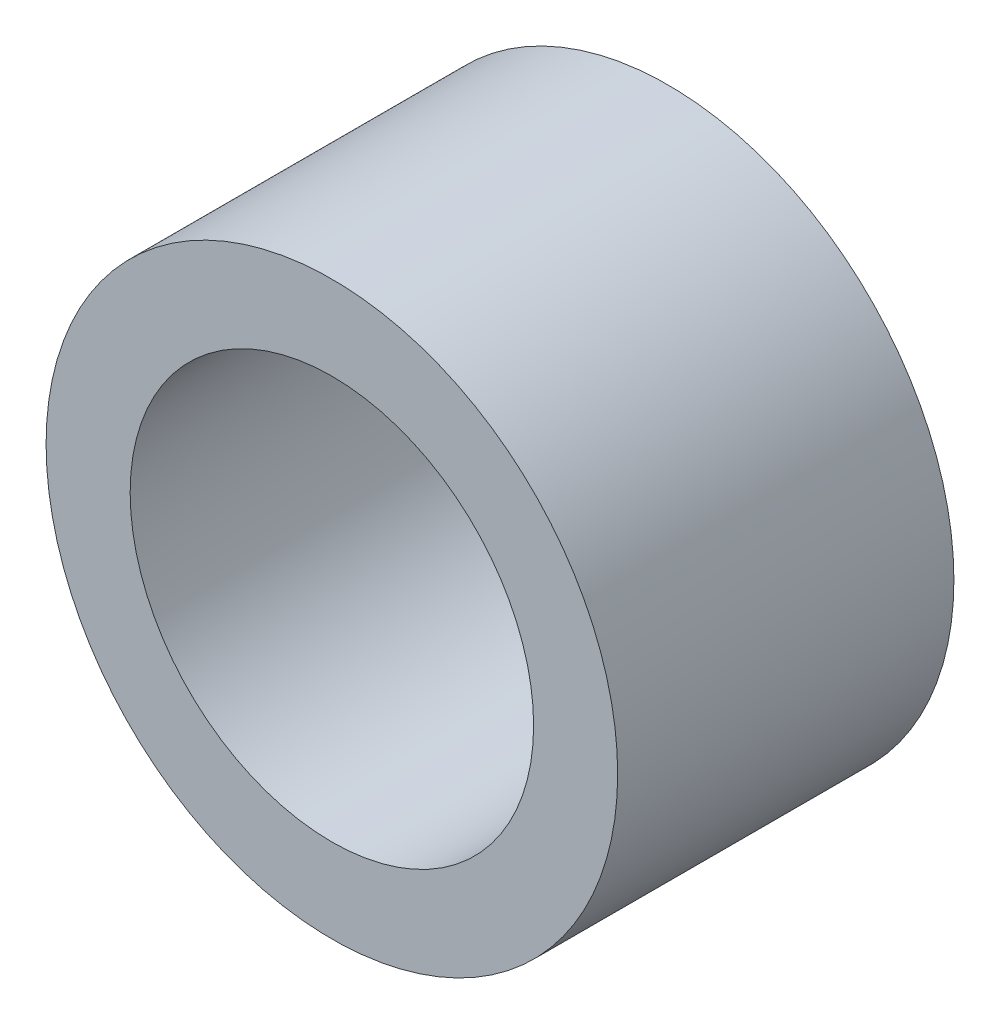
ISO-10303-21;
HEADER;
FILE_DESCRIPTION(('STEP AP214'),'2;1');
FILE_NAME('part.step','',(''),(''),'','','');
FILE_SCHEMA(('AUTOMOTIVE_DESIGN { 1 0 10303 214 1 1 1 1 }'));
ENDSEC;
DATA;
#1=APPLICATION_CONTEXT('core data for automotive mechanical design processes');
#2=APPLICATION_PROTOCOL_DEFINITION('international standard','automotive_design',2000,#1);
#3=PRODUCT_CONTEXT('',#1,'mechanical');
#4=PRODUCT('Part','Part','',(#3));
#5=PRODUCT_RELATED_PRODUCT_CATEGORY('part','',(#4));
#6=PRODUCT_DEFINITION_FORMATION('','',#4);
#7=PRODUCT_DEFINITION_CONTEXT('part definition',#1,'design');
#8=PRODUCT_DEFINITION('design','',#6,#7);
#9=PRODUCT_DEFINITION_SHAPE('','',#8);
#10=(LENGTH_UNIT() NAMED_UNIT(*) SI_UNIT(.MILLI.,.METRE.));
#11=(NAMED_UNIT(*) PLANE_ANGLE_UNIT() SI_UNIT($,.RADIAN.));
#12=(NAMED_UNIT(*) SI_UNIT($,.STERADIAN.) SOLID_ANGLE_UNIT());
#13=UNCERTAINTY_MEASURE_WITH_UNIT(LENGTH_MEASURE(1.E-05),#10,'distance_accuracy_value','');
#14=(GEOMETRIC_REPRESENTATION_CONTEXT(3) GLOBAL_UNCERTAINTY_ASSIGNED_CONTEXT((#13)) GLOBAL_UNIT_ASSIGNED_CONTEXT((#10,
#11,#12)) REPRESENTATION_CONTEXT('',''));
#15=CARTESIAN_POINT('',(0.,0.,0.));
#16=DIRECTION('',(0.,0.,1.));
#17=DIRECTION('',(1.,0.,0.));
#18=AXIS2_PLACEMENT_3D('',#15,#16,#17);
#19=CARTESIAN_POINT('',(0.,0.,10.));
#20=DIRECTION('',(0.,0.,1.));
#21=DIRECTION('',(1.,0.,0.));
#22=AXIS2_PLACEMENT_3D('',#19,#20,#21);
#23=PLANE('',#22);
#24=CARTESIAN_POINT('',(0.,0.,10.));
#25=DIRECTION('',(0.,0.,1.));
#26=DIRECTION('',(1.,0.,0.));
#27=AXIS2_PLACEMENT_3D('',#24,#25,#26);
#28=CIRCLE('',#27,17.);
#29=CARTESIAN_POINT('',(17.,0.,10.));
#30=VERTEX_POINT('',#29);
#31=EDGE_CURVE('E10',#30,#30,#28,.T.);
#32=ORIENTED_EDGE('',*,*,#31,.T.);
#33=EDGE_LOOP('',(#32));
#34=FACE_BOUND('',#33,.T.);
#35=CARTESIAN_POINT('',(0.,0.,10.));
#36=DIRECTION('',(0.,0.,1.));
#37=DIRECTION('',(1.,0.,0.));
#38=AXIS2_PLACEMENT_3D('',#35,#36,#37);
#39=CIRCLE('',#38,12.);
#40=CARTESIAN_POINT('',(12.,0.,10.));
#41=VERTEX_POINT('',#40);
#42=EDGE_CURVE('E48',#41,#41,#39,.T.);
#43=ORIENTED_EDGE('',*,*,#42,.F.);
#44=EDGE_LOOP('',(#43));
#45=FACE_BOUND('',#44,.T.);
#46=ADVANCED_FACE('F37',(#34,#45),#23,.T.);
#47=CARTESIAN_POINT('',(0.,0.,-10.));
#48=DIRECTION('',(0.,0.,1.));
#49=DIRECTION('',(1.,0.,0.));
#50=AXIS2_PLACEMENT_3D('',#47,#48,#49);
#51=PLANE('',#50);
#52=CARTESIAN_POINT('',(0.,0.,-10.));
#53=DIRECTION('',(0.,0.,1.));
#54=DIRECTION('',(1.,0.,0.));
#55=AXIS2_PLACEMENT_3D('',#52,#53,#54);
#56=CIRCLE('',#55,17.);
#57=CARTESIAN_POINT('',(17.,0.,-10.));
#58=VERTEX_POINT('',#57);
#59=EDGE_CURVE('E41',#58,#58,#56,.T.);
#60=ORIENTED_EDGE('',*,*,#59,.F.);
#61=EDGE_LOOP('',(#60));
#62=FACE_BOUND('',#61,.T.);
#63=CARTESIAN_POINT('',(0.,0.,-10.));
#64=DIRECTION('',(0.,0.,1.));
#65=DIRECTION('',(1.,0.,0.));
#66=AXIS2_PLACEMENT_3D('',#63,#64,#65);
#67=CIRCLE('',#66,12.);
#68=CARTESIAN_POINT('',(12.,0.,-10.));
#69=VERTEX_POINT('',#68);
#70=EDGE_CURVE('E50',#69,#69,#67,.T.);
#71=ORIENTED_EDGE('',*,*,#70,.T.);
#72=EDGE_LOOP('',(#71));
#73=FACE_BOUND('',#72,.T.);
#74=ADVANCED_FACE('F60',(#62,#73),#51,.F.);
#75=CARTESIAN_POINT('',(0.,0.,10.));
#76=DIRECTION('',(0.,0.,-1.));
#77=DIRECTION('',(-1.,0.,0.));
#78=AXIS2_PLACEMENT_3D('',#75,#76,#77);
#79=CYLINDRICAL_SURFACE('',#78,17.);
#80=ORIENTED_EDGE('',*,*,#31,.F.);
#81=EDGE_LOOP('',(#80));
#82=FACE_BOUND('',#81,.T.);
#83=ORIENTED_EDGE('',*,*,#59,.T.);
#84=EDGE_LOOP('',(#83));
#85=FACE_BOUND('',#84,.T.);
#86=ADVANCED_FACE('F39',(#82,#85),#79,.T.);
#87=CARTESIAN_POINT('',(0.,0.,10.));
#88=DIRECTION('',(0.,0.,-1.));
#89=DIRECTION('',(-1.,0.,0.));
#90=AXIS2_PLACEMENT_3D('',#87,#88,#89);
#91=CYLINDRICAL_SURFACE('',#90,12.);
#92=ORIENTED_EDGE('',*,*,#42,.T.);
#93=EDGE_LOOP('',(#92));
#94=FACE_BOUND('',#93,.T.);
#95=ORIENTED_EDGE('',*,*,#70,.F.);
#96=EDGE_LOOP('',(#95));
#97=FACE_BOUND('',#96,.T.);
#98=ADVANCED_FACE('F56',(#94,#97),#91,.F.);
#99=CLOSED_SHELL('',(#46,#74,#86,#98));
#100=MANIFOLD_SOLID_BREP('B2',#99);
#101=ADVANCED_BREP_SHAPE_REPRESENTATION('',(#18,#100),#14);
#102=SHAPE_DEFINITION_REPRESENTATION(#9,#101);
ENDSEC;
END-ISO-10303-21;
